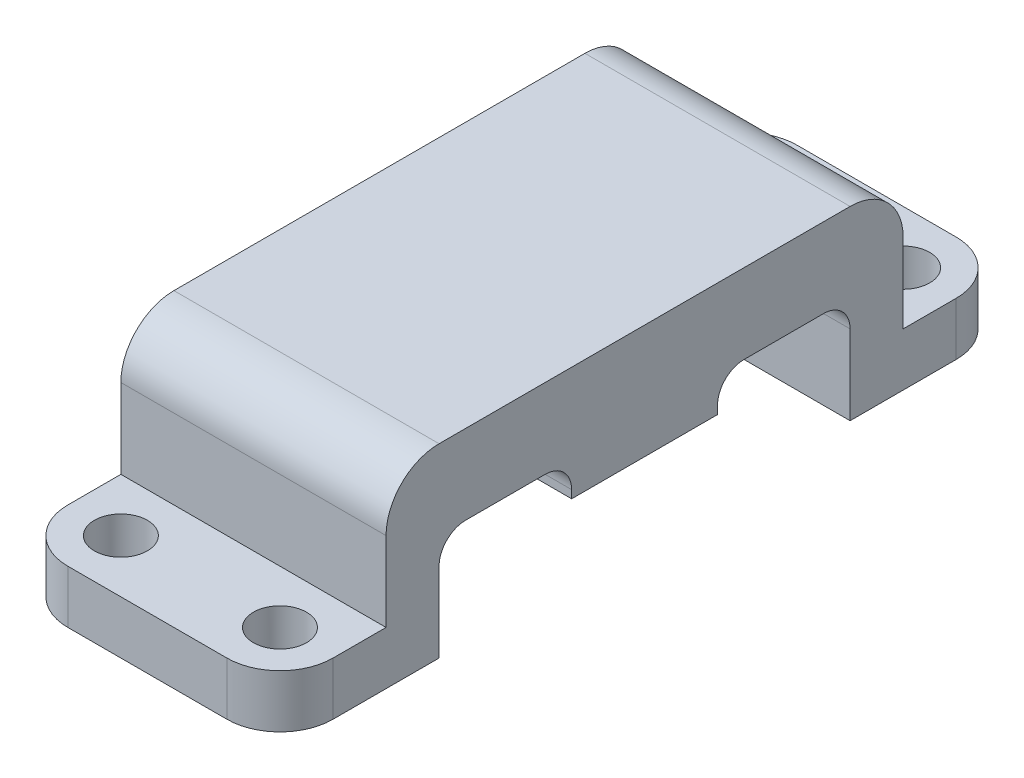
ISO-10303-21;
HEADER;
FILE_DESCRIPTION(('STEP AP214'),'2;1');
FILE_NAME('part.step','',(''),(''),'','','');
FILE_SCHEMA(('AUTOMOTIVE_DESIGN { 1 0 10303 214 1 1 1 1 }'));
ENDSEC;
DATA;
#1=APPLICATION_CONTEXT('core data for automotive mechanical design processes');
#2=APPLICATION_PROTOCOL_DEFINITION('international standard','automotive_design',2000,#1);
#3=PRODUCT_CONTEXT('',#1,'mechanical');
#4=PRODUCT('Part','Part','',(#3));
#5=PRODUCT_RELATED_PRODUCT_CATEGORY('part','',(#4));
#6=PRODUCT_DEFINITION_FORMATION('','',#4);
#7=PRODUCT_DEFINITION_CONTEXT('part definition',#1,'design');
#8=PRODUCT_DEFINITION('design','',#6,#7);
#9=PRODUCT_DEFINITION_SHAPE('','',#8);
#10=(LENGTH_UNIT() NAMED_UNIT(*) SI_UNIT(.MILLI.,.METRE.));
#11=(NAMED_UNIT(*) PLANE_ANGLE_UNIT() SI_UNIT($,.RADIAN.));
#12=(NAMED_UNIT(*) SI_UNIT($,.STERADIAN.) SOLID_ANGLE_UNIT());
#13=UNCERTAINTY_MEASURE_WITH_UNIT(LENGTH_MEASURE(1.E-05),#10,'distance_accuracy_value','');
#14=(GEOMETRIC_REPRESENTATION_CONTEXT(3) GLOBAL_UNCERTAINTY_ASSIGNED_CONTEXT((#13)) GLOBAL_UNIT_ASSIGNED_CONTEXT((#10,
#11,#12)) REPRESENTATION_CONTEXT('',''));
#15=CARTESIAN_POINT('',(0.,0.,0.));
#16=DIRECTION('',(0.,0.,1.));
#17=DIRECTION('',(1.,0.,0.));
#18=AXIS2_PLACEMENT_3D('',#15,#16,#17);
#19=CARTESIAN_POINT('',(10.,0.,2.75));
#20=DIRECTION('',(0.,0.,-1.));
#21=DIRECTION('',(-1.,0.,0.));
#22=AXIS2_PLACEMENT_3D('',#19,#20,#21);
#23=PLANE('',#22);
#24=DIRECTION('',(0.,-1.,0.));
#25=VECTOR('',#24,1.);
#26=CARTESIAN_POINT('',(10.,0.,2.75));
#27=LINE('',#26,#25);
#28=CARTESIAN_POINT('',(10.,-1.,2.75));
#29=VERTEX_POINT('',#28);
#30=CARTESIAN_POINT('',(10.,-1.3,2.75));
#31=VERTEX_POINT('',#30);
#32=EDGE_CURVE('E207',#29,#31,#27,.T.);
#33=ORIENTED_EDGE('',*,*,#32,.F.);
#34=DIRECTION('',(-1.,0.,0.));
#35=VECTOR('',#34,1.);
#36=CARTESIAN_POINT('',(0.,-1.,2.75));
#37=LINE('',#36,#35);
#38=CARTESIAN_POINT('',(0.,-1.,2.75));
#39=VERTEX_POINT('',#38);
#40=EDGE_CURVE('E311',#29,#39,#37,.T.);
#41=ORIENTED_EDGE('',*,*,#40,.T.);
#42=DIRECTION('',(0.,-1.,0.));
#43=VECTOR('',#42,1.);
#44=CARTESIAN_POINT('',(0.,0.,2.75));
#45=LINE('',#44,#43);
#46=CARTESIAN_POINT('',(0.,-1.3,2.75));
#47=VERTEX_POINT('',#46);
#48=EDGE_CURVE('E233',#39,#47,#45,.T.);
#49=ORIENTED_EDGE('',*,*,#48,.T.);
#50=DIRECTION('',(-1.,0.,0.));
#51=VECTOR('',#50,1.);
#52=CARTESIAN_POINT('',(10.,-1.3,2.75));
#53=LINE('',#52,#51);
#54=EDGE_CURVE('E226',#31,#47,#53,.T.);
#55=ORIENTED_EDGE('',*,*,#54,.F.);
#56=EDGE_LOOP('',(#33,#41,#49,#55));
#57=FACE_BOUND('',#56,.T.);
#58=ADVANCED_FACE('F35',(#57),#23,.F.);
#59=CARTESIAN_POINT('',(10.,-1.3,2.75));
#60=DIRECTION('',(0.,1.,0.));
#61=DIRECTION('',(0.,0.,1.));
#62=AXIS2_PLACEMENT_3D('',#59,#60,#61);
#63=PLANE('',#62);
#64=DIRECTION('',(0.,0.,-1.));
#65=VECTOR('',#64,1.);
#66=CARTESIAN_POINT('',(0.,-1.3,2.75));
#67=LINE('',#66,#65);
#68=CARTESIAN_POINT('',(0.,-1.3,-2.75));
#69=VERTEX_POINT('',#68);
#70=EDGE_CURVE('E435',#47,#69,#67,.T.);
#71=ORIENTED_EDGE('',*,*,#70,.T.);
#72=DIRECTION('',(-1.,0.,0.));
#73=VECTOR('',#72,1.);
#74=CARTESIAN_POINT('',(10.,-1.3,-2.75));
#75=LINE('',#74,#73);
#76=CARTESIAN_POINT('',(10.,-1.3,-2.75));
#77=VERTEX_POINT('',#76);
#78=EDGE_CURVE('E228',#77,#69,#75,.T.);
#79=ORIENTED_EDGE('',*,*,#78,.F.);
#80=DIRECTION('',(0.,0.,-1.));
#81=VECTOR('',#80,1.);
#82=CARTESIAN_POINT('',(10.,-1.3,2.75));
#83=LINE('',#82,#81);
#84=EDGE_CURVE('E212',#31,#77,#83,.T.);
#85=ORIENTED_EDGE('',*,*,#84,.F.);
#86=ORIENTED_EDGE('',*,*,#54,.T.);
#87=EDGE_LOOP('',(#71,#79,#85,#86));
#88=FACE_BOUND('',#87,.T.);
#89=ADVANCED_FACE('F225',(#88),#63,.F.);
#90=CARTESIAN_POINT('',(10.,0.,-2.75));
#91=DIRECTION('',(0.,0.,1.));
#92=DIRECTION('',(1.,0.,0.));
#93=AXIS2_PLACEMENT_3D('',#90,#91,#92);
#94=PLANE('',#93);
#95=DIRECTION('',(0.,1.,0.));
#96=VECTOR('',#95,1.);
#97=CARTESIAN_POINT('',(0.,0.,-2.75));
#98=LINE('',#97,#96);
#99=CARTESIAN_POINT('',(0.,-1.,-2.75));
#100=VERTEX_POINT('',#99);
#101=EDGE_CURVE('E437',#69,#100,#98,.T.);
#102=ORIENTED_EDGE('',*,*,#101,.T.);
#103=DIRECTION('',(-1.,0.,0.));
#104=VECTOR('',#103,1.);
#105=CARTESIAN_POINT('',(10.,-1.,-2.75));
#106=LINE('',#105,#104);
#107=CARTESIAN_POINT('',(10.,-1.,-2.75));
#108=VERTEX_POINT('',#107);
#109=EDGE_CURVE('E309',#100,#108,#106,.F.);
#110=ORIENTED_EDGE('',*,*,#109,.T.);
#111=DIRECTION('',(0.,1.,0.));
#112=VECTOR('',#111,1.);
#113=CARTESIAN_POINT('',(10.,0.,-2.75));
#114=LINE('',#113,#112);
#115=EDGE_CURVE('E230',#77,#108,#114,.T.);
#116=ORIENTED_EDGE('',*,*,#115,.F.);
#117=ORIENTED_EDGE('',*,*,#78,.T.);
#118=EDGE_LOOP('',(#102,#110,#116,#117));
#119=FACE_BOUND('',#118,.T.);
#120=ADVANCED_FACE('F356',(#119),#94,.F.);
#121=CARTESIAN_POINT('',(10.,0.,-2.75));
#122=DIRECTION('',(0.,1.,0.));
#123=DIRECTION('',(0.,0.,1.));
#124=AXIS2_PLACEMENT_3D('',#121,#122,#123);
#125=PLANE('',#124);
#126=DIRECTION('',(0.,0.,-1.));
#127=VECTOR('',#126,1.);
#128=CARTESIAN_POINT('',(0.,0.,-2.75));
#129=LINE('',#128,#127);
#130=CARTESIAN_POINT('',(0.,0.,-3.75));
#131=VERTEX_POINT('',#130);
#132=CARTESIAN_POINT('',(0.,0.,-6.75));
#133=VERTEX_POINT('',#132);
#134=EDGE_CURVE('E440',#131,#133,#129,.T.);
#135=ORIENTED_EDGE('',*,*,#134,.T.);
#136=DIRECTION('',(-1.,0.,0.));
#137=VECTOR('',#136,1.);
#138=CARTESIAN_POINT('',(10.,0.,-6.75));
#139=LINE('',#138,#137);
#140=CARTESIAN_POINT('',(10.,0.,-6.75));
#141=VERTEX_POINT('',#140);
#142=EDGE_CURVE('E307',#133,#141,#139,.F.);
#143=ORIENTED_EDGE('',*,*,#142,.T.);
#144=DIRECTION('',(0.,0.,-1.));
#145=VECTOR('',#144,1.);
#146=CARTESIAN_POINT('',(10.,0.,-2.75));
#147=LINE('',#146,#145);
#148=CARTESIAN_POINT('',(10.,0.,-3.75));
#149=VERTEX_POINT('',#148);
#150=EDGE_CURVE('E403',#149,#141,#147,.T.);
#151=ORIENTED_EDGE('',*,*,#150,.F.);
#152=DIRECTION('',(-1.,0.,0.));
#153=VECTOR('',#152,1.);
#154=CARTESIAN_POINT('',(0.,0.,-3.75));
#155=LINE('',#154,#153);
#156=EDGE_CURVE('E304',#149,#131,#155,.T.);
#157=ORIENTED_EDGE('',*,*,#156,.T.);
#158=EDGE_LOOP('',(#135,#143,#151,#157));
#159=FACE_BOUND('',#158,.T.);
#160=ADVANCED_FACE('F572',(#159),#125,.F.);
#161=CARTESIAN_POINT('',(10.,0.,-7.75));
#162=DIRECTION('',(0.,0.,-1.));
#163=DIRECTION('',(0.,1.,0.));
#164=AXIS2_PLACEMENT_3D('',#161,#162,#163);
#165=PLANE('',#164);
#166=DIRECTION('',(0.,-1.,0.));
#167=VECTOR('',#166,1.);
#168=CARTESIAN_POINT('',(10.,0.,-7.75));
#169=LINE('',#168,#167);
#170=CARTESIAN_POINT('',(10.,-1.,-7.75));
#171=VERTEX_POINT('',#170);
#172=CARTESIAN_POINT('',(10.,-4.,-7.75));
#173=VERTEX_POINT('',#172);
#174=EDGE_CURVE('E400',#171,#173,#169,.T.);
#175=ORIENTED_EDGE('',*,*,#174,.F.);
#176=DIRECTION('',(-1.,0.,0.));
#177=VECTOR('',#176,1.);
#178=CARTESIAN_POINT('',(0.,-1.,-7.75));
#179=LINE('',#178,#177);
#180=CARTESIAN_POINT('',(0.,-1.,-7.75));
#181=VERTEX_POINT('',#180);
#182=EDGE_CURVE('E294',#171,#181,#179,.T.);
#183=ORIENTED_EDGE('',*,*,#182,.T.);
#184=DIRECTION('',(0.,-1.,0.));
#185=VECTOR('',#184,1.);
#186=CARTESIAN_POINT('',(0.,0.,-7.75));
#187=LINE('',#186,#185);
#188=CARTESIAN_POINT('',(0.,-4.,-7.75));
#189=VERTEX_POINT('',#188);
#190=EDGE_CURVE('E443',#181,#189,#187,.T.);
#191=ORIENTED_EDGE('',*,*,#190,.T.);
#192=DIRECTION('',(-1.,0.,0.));
#193=VECTOR('',#192,1.);
#194=CARTESIAN_POINT('',(10.,-4.,-7.75));
#195=LINE('',#194,#193);
#196=EDGE_CURVE('E239',#173,#189,#195,.T.);
#197=ORIENTED_EDGE('',*,*,#196,.F.);
#198=EDGE_LOOP('',(#175,#183,#191,#197));
#199=FACE_BOUND('',#198,.T.);
#200=ADVANCED_FACE('F405',(#199),#165,.F.);
#201=CARTESIAN_POINT('',(10.,-4.,-7.75));
#202=DIRECTION('',(0.,1.,0.));
#203=DIRECTION('',(0.,0.,1.));
#204=AXIS2_PLACEMENT_3D('',#201,#202,#203);
#205=PLANE('',#204);
#206=CARTESIAN_POINT('',(8.,-4.,-11.75));
#207=DIRECTION('',(0.,1.,0.));
#208=DIRECTION('',(0.,0.,-1.));
#209=AXIS2_PLACEMENT_3D('',#206,#207,#208);
#210=CIRCLE('',#209,1.);
#211=CARTESIAN_POINT('',(8.,-4.,-12.75));
#212=VERTEX_POINT('',#211);
#213=EDGE_CURVE('E594',#212,#212,#210,.T.);
#214=ORIENTED_EDGE('',*,*,#213,.T.);
#215=EDGE_LOOP('',(#214));
#216=FACE_BOUND('',#215,.T.);
#217=CARTESIAN_POINT('',(2.,-4.,-11.75));
#218=DIRECTION('',(0.,1.,0.));
#219=DIRECTION('',(0.,0.,-1.));
#220=AXIS2_PLACEMENT_3D('',#217,#218,#219);
#221=CIRCLE('',#220,1.);
#222=CARTESIAN_POINT('',(2.,-4.,-12.75));
#223=VERTEX_POINT('',#222);
#224=EDGE_CURVE('E597',#223,#223,#221,.T.);
#225=ORIENTED_EDGE('',*,*,#224,.T.);
#226=EDGE_LOOP('',(#225));
#227=FACE_BOUND('',#226,.T.);
#228=DIRECTION('',(0.,0.,-1.));
#229=VECTOR('',#228,1.);
#230=CARTESIAN_POINT('',(0.,-4.,-7.75));
#231=LINE('',#230,#229);
#232=CARTESIAN_POINT('',(0.,-4.,-11.75));
#233=VERTEX_POINT('',#232);
#234=EDGE_CURVE('E445',#189,#233,#231,.T.);
#235=ORIENTED_EDGE('',*,*,#234,.T.);
#236=CARTESIAN_POINT('',(2.,-4.,-11.75));
#237=DIRECTION('',(0.,1.,0.));
#238=DIRECTION('',(0.,0.,1.));
#239=AXIS2_PLACEMENT_3D('',#236,#237,#238);
#240=CIRCLE('',#239,2.);
#241=CARTESIAN_POINT('',(2.,-4.,-13.75));
#242=VERTEX_POINT('',#241);
#243=EDGE_CURVE('E279',#233,#242,#240,.F.);
#244=ORIENTED_EDGE('',*,*,#243,.T.);
#245=DIRECTION('',(-1.,0.,0.));
#246=VECTOR('',#245,1.);
#247=CARTESIAN_POINT('',(10.,-4.,-13.75));
#248=LINE('',#247,#246);
#249=CARTESIAN_POINT('',(8.,-4.,-13.75));
#250=VERTEX_POINT('',#249);
#251=EDGE_CURVE('E481',#250,#242,#248,.T.);
#252=ORIENTED_EDGE('',*,*,#251,.F.);
#253=CARTESIAN_POINT('',(8.,-4.,-11.75));
#254=DIRECTION('',(0.,1.,0.));
#255=DIRECTION('',(0.,0.,1.));
#256=AXIS2_PLACEMENT_3D('',#253,#254,#255);
#257=CIRCLE('',#256,2.);
#258=CARTESIAN_POINT('',(10.,-4.,-11.75));
#259=VERTEX_POINT('',#258);
#260=EDGE_CURVE('E277',#250,#259,#257,.F.);
#261=ORIENTED_EDGE('',*,*,#260,.T.);
#262=DIRECTION('',(0.,0.,-1.));
#263=VECTOR('',#262,1.);
#264=CARTESIAN_POINT('',(10.,-4.,-7.75));
#265=LINE('',#264,#263);
#266=EDGE_CURVE('E409',#173,#259,#265,.T.);
#267=ORIENTED_EDGE('',*,*,#266,.F.);
#268=ORIENTED_EDGE('',*,*,#196,.T.);
#269=EDGE_LOOP('',(#235,#244,#252,#261,#267,#268));
#270=FACE_BOUND('',#269,.T.);
#271=ADVANCED_FACE('F485',(#216,#227,#270),#205,.F.);
#272=CARTESIAN_POINT('',(10.,-4.,-13.75));
#273=DIRECTION('',(0.,0.,1.));
#274=DIRECTION('',(1.,0.,0.));
#275=AXIS2_PLACEMENT_3D('',#272,#273,#274);
#276=PLANE('',#275);
#277=ORIENTED_EDGE('',*,*,#251,.T.);
#278=DIRECTION('',(0.,1.,0.));
#279=VECTOR('',#278,1.);
#280=CARTESIAN_POINT('',(2.,-4.,-13.75));
#281=LINE('',#280,#279);
#282=CARTESIAN_POINT('',(2.,-2.,-13.75));
#283=VERTEX_POINT('',#282);
#284=EDGE_CURVE('E270',#242,#283,#281,.T.);
#285=ORIENTED_EDGE('',*,*,#284,.T.);
#286=DIRECTION('',(-1.,0.,0.));
#287=VECTOR('',#286,1.);
#288=CARTESIAN_POINT('',(10.,-2.,-13.75));
#289=LINE('',#288,#287);
#290=CARTESIAN_POINT('',(8.,-2.,-13.75));
#291=VERTEX_POINT('',#290);
#292=EDGE_CURVE('E478',#291,#283,#289,.T.);
#293=ORIENTED_EDGE('',*,*,#292,.F.);
#294=DIRECTION('',(0.,1.,0.));
#295=VECTOR('',#294,1.);
#296=CARTESIAN_POINT('',(8.,-4.,-13.75));
#297=LINE('',#296,#295);
#298=EDGE_CURVE('E268',#291,#250,#297,.F.);
#299=ORIENTED_EDGE('',*,*,#298,.T.);
#300=EDGE_LOOP('',(#277,#285,#293,#299));
#301=FACE_BOUND('',#300,.T.);
#302=ADVANCED_FACE('F494',(#301),#276,.F.);
#303=CARTESIAN_POINT('',(10.,-2.,-13.75));
#304=DIRECTION('',(0.,-1.,0.));
#305=DIRECTION('',(0.,0.,-1.));
#306=AXIS2_PLACEMENT_3D('',#303,#304,#305);
#307=PLANE('',#306);
#308=CARTESIAN_POINT('',(8.,-2.,-11.75));
#309=DIRECTION('',(0.,-1.,0.));
#310=DIRECTION('',(0.,0.,-1.));
#311=AXIS2_PLACEMENT_3D('',#308,#309,#310);
#312=CIRCLE('',#311,1.);
#313=CARTESIAN_POINT('',(8.,-2.,-12.75));
#314=VERTEX_POINT('',#313);
#315=EDGE_CURVE('E298',#314,#314,#312,.T.);
#316=ORIENTED_EDGE('',*,*,#315,.T.);
#317=EDGE_LOOP('',(#316));
#318=FACE_BOUND('',#317,.T.);
#319=CARTESIAN_POINT('',(2.,-2.,-11.75));
#320=DIRECTION('',(0.,-1.,0.));
#321=DIRECTION('',(0.,0.,-1.));
#322=AXIS2_PLACEMENT_3D('',#319,#320,#321);
#323=CIRCLE('',#322,1.);
#324=CARTESIAN_POINT('',(2.,-2.,-12.75));
#325=VERTEX_POINT('',#324);
#326=EDGE_CURVE('E295',#325,#325,#323,.T.);
#327=ORIENTED_EDGE('',*,*,#326,.T.);
#328=EDGE_LOOP('',(#327));
#329=FACE_BOUND('',#328,.T.);
#330=ORIENTED_EDGE('',*,*,#292,.T.);
#331=CARTESIAN_POINT('',(2.,-2.,-11.75));
#332=DIRECTION('',(0.,-1.,0.));
#333=DIRECTION('',(0.,0.,-1.));
#334=AXIS2_PLACEMENT_3D('',#331,#332,#333);
#335=CIRCLE('',#334,2.);
#336=CARTESIAN_POINT('',(0.,-2.,-11.75));
#337=VERTEX_POINT('',#336);
#338=EDGE_CURVE('E275',#283,#337,#335,.F.);
#339=ORIENTED_EDGE('',*,*,#338,.T.);
#340=DIRECTION('',(0.,0.,1.));
#341=VECTOR('',#340,1.);
#342=CARTESIAN_POINT('',(0.,-2.,-13.75));
#343=LINE('',#342,#341);
#344=CARTESIAN_POINT('',(0.,-2.,-9.75));
#345=VERTEX_POINT('',#344);
#346=EDGE_CURVE('E448',#337,#345,#343,.T.);
#347=ORIENTED_EDGE('',*,*,#346,.T.);
#348=DIRECTION('',(-1.,0.,0.));
#349=VECTOR('',#348,1.);
#350=CARTESIAN_POINT('',(10.,-2.,-9.75));
#351=LINE('',#350,#349);
#352=CARTESIAN_POINT('',(10.,-2.,-9.75));
#353=VERTEX_POINT('',#352);
#354=EDGE_CURVE('E475',#353,#345,#351,.T.);
#355=ORIENTED_EDGE('',*,*,#354,.F.);
#356=DIRECTION('',(0.,0.,1.));
#357=VECTOR('',#356,1.);
#358=CARTESIAN_POINT('',(10.,-2.,-13.75));
#359=LINE('',#358,#357);
#360=CARTESIAN_POINT('',(10.,-2.,-11.75));
#361=VERTEX_POINT('',#360);
#362=EDGE_CURVE('E411',#361,#353,#359,.T.);
#363=ORIENTED_EDGE('',*,*,#362,.F.);
#364=CARTESIAN_POINT('',(8.,-2.,-11.75));
#365=DIRECTION('',(0.,-1.,0.));
#366=DIRECTION('',(0.,0.,-1.));
#367=AXIS2_PLACEMENT_3D('',#364,#365,#366);
#368=CIRCLE('',#367,2.);
#369=EDGE_CURVE('E273',#361,#291,#368,.F.);
#370=ORIENTED_EDGE('',*,*,#369,.T.);
#371=EDGE_LOOP('',(#330,#339,#347,#355,#363,#370));
#372=FACE_BOUND('',#371,.T.);
#373=ADVANCED_FACE('F501',(#318,#329,#372),#307,.F.);
#374=CARTESIAN_POINT('',(10.,-2.,-9.75));
#375=DIRECTION('',(0.,0.,1.));
#376=DIRECTION('',(0.,-1.,0.));
#377=AXIS2_PLACEMENT_3D('',#374,#375,#376);
#378=PLANE('',#377);
#379=DIRECTION('',(0.,1.,0.));
#380=VECTOR('',#379,1.);
#381=CARTESIAN_POINT('',(0.,-2.,-9.75));
#382=LINE('',#381,#380);
#383=CARTESIAN_POINT('',(0.,0.999999999999999,-9.75));
#384=VERTEX_POINT('',#383);
#385=EDGE_CURVE('E450',#345,#384,#382,.T.);
#386=ORIENTED_EDGE('',*,*,#385,.T.);
#387=DIRECTION('',(-1.,0.,0.));
#388=VECTOR('',#387,1.);
#389=CARTESIAN_POINT('',(10.,1.,-9.75));
#390=LINE('',#389,#388);
#391=CARTESIAN_POINT('',(10.,0.999999999999999,-9.75));
#392=VERTEX_POINT('',#391);
#393=EDGE_CURVE('E253',#384,#392,#390,.F.);
#394=ORIENTED_EDGE('',*,*,#393,.T.);
#395=DIRECTION('',(0.,1.,0.));
#396=VECTOR('',#395,1.);
#397=CARTESIAN_POINT('',(10.,-2.,-9.75));
#398=LINE('',#397,#396);
#399=EDGE_CURVE('E417',#353,#392,#398,.T.);
#400=ORIENTED_EDGE('',*,*,#399,.F.);
#401=ORIENTED_EDGE('',*,*,#354,.T.);
#402=EDGE_LOOP('',(#386,#394,#400,#401));
#403=FACE_BOUND('',#402,.T.);
#404=ADVANCED_FACE('F504',(#403),#378,.F.);
#405=CARTESIAN_POINT('',(10.,3.,9.75));
#406=DIRECTION('',(0.,-1.,0.));
#407=DIRECTION('',(0.,0.,-1.));
#408=AXIS2_PLACEMENT_3D('',#405,#406,#407);
#409=PLANE('',#408);
#410=DIRECTION('',(0.,0.,1.));
#411=VECTOR('',#410,1.);
#412=CARTESIAN_POINT('',(10.,3.,9.75));
#413=LINE('',#412,#411);
#414=CARTESIAN_POINT('',(10.,3.,-7.75));
#415=VERTEX_POINT('',#414);
#416=CARTESIAN_POINT('',(10.,3.,7.75));
#417=VERTEX_POINT('',#416);
#418=EDGE_CURVE('E419',#415,#417,#413,.T.);
#419=ORIENTED_EDGE('',*,*,#418,.F.);
#420=DIRECTION('',(-1.,0.,0.));
#421=VECTOR('',#420,1.);
#422=CARTESIAN_POINT('',(10.,3.,-7.75));
#423=LINE('',#422,#421);
#424=CARTESIAN_POINT('',(0.,3.,-7.75));
#425=VERTEX_POINT('',#424);
#426=EDGE_CURVE('E237',#415,#425,#423,.T.);
#427=ORIENTED_EDGE('',*,*,#426,.T.);
#428=DIRECTION('',(0.,0.,1.));
#429=VECTOR('',#428,1.);
#430=CARTESIAN_POINT('',(0.,3.,9.75));
#431=LINE('',#430,#429);
#432=CARTESIAN_POINT('',(0.,3.,7.75));
#433=VERTEX_POINT('',#432);
#434=EDGE_CURVE('E453',#425,#433,#431,.T.);
#435=ORIENTED_EDGE('',*,*,#434,.T.);
#436=DIRECTION('',(-1.,0.,0.));
#437=VECTOR('',#436,1.);
#438=CARTESIAN_POINT('',(10.,3.,7.75));
#439=LINE('',#438,#437);
#440=EDGE_CURVE('E235',#433,#417,#439,.F.);
#441=ORIENTED_EDGE('',*,*,#440,.T.);
#442=EDGE_LOOP('',(#419,#427,#435,#441));
#443=FACE_BOUND('',#442,.T.);
#444=ADVANCED_FACE('F510',(#443),#409,.F.);
#445=CARTESIAN_POINT('',(10.,-2.,9.75));
#446=DIRECTION('',(0.,0.,-1.));
#447=DIRECTION('',(0.,1.,0.));
#448=AXIS2_PLACEMENT_3D('',#445,#446,#447);
#449=PLANE('',#448);
#450=DIRECTION('',(0.,-1.,0.));
#451=VECTOR('',#450,1.);
#452=CARTESIAN_POINT('',(10.,-2.,9.75));
#453=LINE('',#452,#451);
#454=CARTESIAN_POINT('',(10.,0.999999999999999,9.75));
#455=VERTEX_POINT('',#454);
#456=CARTESIAN_POINT('',(10.,-2.,9.75));
#457=VERTEX_POINT('',#456);
#458=EDGE_CURVE('E422',#455,#457,#453,.T.);
#459=ORIENTED_EDGE('',*,*,#458,.F.);
#460=DIRECTION('',(-1.,0.,0.));
#461=VECTOR('',#460,1.);
#462=CARTESIAN_POINT('',(10.,1.,9.75));
#463=LINE('',#462,#461);
#464=CARTESIAN_POINT('',(0.,0.999999999999999,9.75));
#465=VERTEX_POINT('',#464);
#466=EDGE_CURVE('E265',#455,#465,#463,.T.);
#467=ORIENTED_EDGE('',*,*,#466,.T.);
#468=DIRECTION('',(0.,-1.,0.));
#469=VECTOR('',#468,1.);
#470=CARTESIAN_POINT('',(0.,-2.,9.75));
#471=LINE('',#470,#469);
#472=CARTESIAN_POINT('',(0.,-2.,9.75));
#473=VERTEX_POINT('',#472);
#474=EDGE_CURVE('E456',#465,#473,#471,.T.);
#475=ORIENTED_EDGE('',*,*,#474,.T.);
#476=DIRECTION('',(-1.,0.,0.));
#477=VECTOR('',#476,1.);
#478=CARTESIAN_POINT('',(10.,-2.,9.75));
#479=LINE('',#478,#477);
#480=EDGE_CURVE('E472',#457,#473,#479,.T.);
#481=ORIENTED_EDGE('',*,*,#480,.F.);
#482=EDGE_LOOP('',(#459,#467,#475,#481));
#483=FACE_BOUND('',#482,.T.);
#484=ADVANCED_FACE('F518',(#483),#449,.F.);
#485=CARTESIAN_POINT('',(10.,-2.,13.75));
#486=DIRECTION('',(0.,-1.,0.));
#487=DIRECTION('',(0.,0.,-1.));
#488=AXIS2_PLACEMENT_3D('',#485,#486,#487);
#489=PLANE('',#488);
#490=CARTESIAN_POINT('',(2.,-2.,11.75));
#491=DIRECTION('',(0.,-1.,0.));
#492=DIRECTION('',(0.,0.,-1.));
#493=AXIS2_PLACEMENT_3D('',#490,#491,#492);
#494=CIRCLE('',#493,1.);
#495=CARTESIAN_POINT('',(2.,-2.,10.75));
#496=VERTEX_POINT('',#495);
#497=EDGE_CURVE('E299',#496,#496,#494,.T.);
#498=ORIENTED_EDGE('',*,*,#497,.T.);
#499=EDGE_LOOP('',(#498));
#500=FACE_BOUND('',#499,.T.);
#501=CARTESIAN_POINT('',(8.,-2.,11.75));
#502=DIRECTION('',(0.,-1.,0.));
#503=DIRECTION('',(0.,0.,-1.));
#504=AXIS2_PLACEMENT_3D('',#501,#502,#503);
#505=CIRCLE('',#504,1.);
#506=CARTESIAN_POINT('',(8.,-2.,10.75));
#507=VERTEX_POINT('',#506);
#508=EDGE_CURVE('E587',#507,#507,#505,.T.);
#509=ORIENTED_EDGE('',*,*,#508,.T.);
#510=EDGE_LOOP('',(#509));
#511=FACE_BOUND('',#510,.T.);
#512=DIRECTION('',(0.,0.,1.));
#513=VECTOR('',#512,1.);
#514=CARTESIAN_POINT('',(0.,-2.,13.75));
#515=LINE('',#514,#513);
#516=CARTESIAN_POINT('',(0.,-2.,11.75));
#517=VERTEX_POINT('',#516);
#518=EDGE_CURVE('E458',#473,#517,#515,.T.);
#519=ORIENTED_EDGE('',*,*,#518,.T.);
#520=CARTESIAN_POINT('',(2.,-2.,11.75));
#521=DIRECTION('',(0.,-1.,0.));
#522=DIRECTION('',(0.,0.,-1.));
#523=AXIS2_PLACEMENT_3D('',#520,#521,#522);
#524=CIRCLE('',#523,2.);
#525=CARTESIAN_POINT('',(2.,-2.,13.75));
#526=VERTEX_POINT('',#525);
#527=EDGE_CURVE('E292',#517,#526,#524,.F.);
#528=ORIENTED_EDGE('',*,*,#527,.T.);
#529=DIRECTION('',(-1.,0.,0.));
#530=VECTOR('',#529,1.);
#531=CARTESIAN_POINT('',(10.,-2.,13.75));
#532=LINE('',#531,#530);
#533=CARTESIAN_POINT('',(8.,-2.,13.75));
#534=VERTEX_POINT('',#533);
#535=EDGE_CURVE('E469',#534,#526,#532,.T.);
#536=ORIENTED_EDGE('',*,*,#535,.F.);
#537=CARTESIAN_POINT('',(8.,-2.,11.75));
#538=DIRECTION('',(0.,-1.,0.));
#539=DIRECTION('',(0.,0.,-1.));
#540=AXIS2_PLACEMENT_3D('',#537,#538,#539);
#541=CIRCLE('',#540,2.);
#542=CARTESIAN_POINT('',(10.,-2.,11.75));
#543=VERTEX_POINT('',#542);
#544=EDGE_CURVE('E290',#534,#543,#541,.F.);
#545=ORIENTED_EDGE('',*,*,#544,.T.);
#546=DIRECTION('',(0.,0.,1.));
#547=VECTOR('',#546,1.);
#548=CARTESIAN_POINT('',(10.,-2.,13.75));
#549=LINE('',#548,#547);
#550=EDGE_CURVE('E424',#457,#543,#549,.T.);
#551=ORIENTED_EDGE('',*,*,#550,.F.);
#552=ORIENTED_EDGE('',*,*,#480,.T.);
#553=EDGE_LOOP('',(#519,#528,#536,#545,#551,#552));
#554=FACE_BOUND('',#553,.T.);
#555=ADVANCED_FACE('F552',(#500,#511,#554),#489,.F.);
#556=CARTESIAN_POINT('',(10.,-4.,13.75));
#557=DIRECTION('',(0.,0.,-1.));
#558=DIRECTION('',(-1.,0.,0.));
#559=AXIS2_PLACEMENT_3D('',#556,#557,#558);
#560=PLANE('',#559);
#561=ORIENTED_EDGE('',*,*,#535,.T.);
#562=DIRECTION('',(0.,-1.,0.));
#563=VECTOR('',#562,1.);
#564=CARTESIAN_POINT('',(2.,-4.,13.75));
#565=LINE('',#564,#563);
#566=CARTESIAN_POINT('',(2.,-4.,13.75));
#567=VERTEX_POINT('',#566);
#568=EDGE_CURVE('E283',#526,#567,#565,.T.);
#569=ORIENTED_EDGE('',*,*,#568,.T.);
#570=DIRECTION('',(-1.,0.,0.));
#571=VECTOR('',#570,1.);
#572=CARTESIAN_POINT('',(10.,-4.,13.75));
#573=LINE('',#572,#571);
#574=CARTESIAN_POINT('',(8.,-4.,13.75));
#575=VERTEX_POINT('',#574);
#576=EDGE_CURVE('E466',#575,#567,#573,.T.);
#577=ORIENTED_EDGE('',*,*,#576,.F.);
#578=DIRECTION('',(0.,-1.,0.));
#579=VECTOR('',#578,1.);
#580=CARTESIAN_POINT('',(8.,-2.,13.75));
#581=LINE('',#580,#579);
#582=EDGE_CURVE('E281',#575,#534,#581,.F.);
#583=ORIENTED_EDGE('',*,*,#582,.T.);
#584=EDGE_LOOP('',(#561,#569,#577,#583));
#585=FACE_BOUND('',#584,.T.);
#586=ADVANCED_FACE('F531',(#585),#560,.F.);
#587=CARTESIAN_POINT('',(10.,-4.,7.75));
#588=DIRECTION('',(0.,1.,0.));
#589=DIRECTION('',(0.,0.,1.));
#590=AXIS2_PLACEMENT_3D('',#587,#588,#589);
#591=PLANE('',#590);
#592=CARTESIAN_POINT('',(2.,-4.,11.75));
#593=DIRECTION('',(0.,1.,0.));
#594=DIRECTION('',(0.,0.,1.));
#595=AXIS2_PLACEMENT_3D('',#592,#593,#594);
#596=CIRCLE('',#595,1.);
#597=CARTESIAN_POINT('',(2.,-4.,12.75));
#598=VERTEX_POINT('',#597);
#599=EDGE_CURVE('E593',#598,#598,#596,.T.);
#600=ORIENTED_EDGE('',*,*,#599,.T.);
#601=EDGE_LOOP('',(#600));
#602=FACE_BOUND('',#601,.T.);
#603=CARTESIAN_POINT('',(8.,-4.,11.75));
#604=DIRECTION('',(0.,1.,0.));
#605=DIRECTION('',(0.,0.,1.));
#606=AXIS2_PLACEMENT_3D('',#603,#604,#605);
#607=CIRCLE('',#606,1.);
#608=CARTESIAN_POINT('',(8.,-4.,12.75));
#609=VERTEX_POINT('',#608);
#610=EDGE_CURVE('E590',#609,#609,#607,.T.);
#611=ORIENTED_EDGE('',*,*,#610,.T.);
#612=EDGE_LOOP('',(#611));
#613=FACE_BOUND('',#612,.T.);
#614=ORIENTED_EDGE('',*,*,#576,.T.);
#615=CARTESIAN_POINT('',(2.,-4.,11.75));
#616=DIRECTION('',(0.,1.,0.));
#617=DIRECTION('',(0.,0.,1.));
#618=AXIS2_PLACEMENT_3D('',#615,#616,#617);
#619=CIRCLE('',#618,2.);
#620=CARTESIAN_POINT('',(0.,-4.,11.75));
#621=VERTEX_POINT('',#620);
#622=EDGE_CURVE('E288',#567,#621,#619,.F.);
#623=ORIENTED_EDGE('',*,*,#622,.T.);
#624=DIRECTION('',(0.,0.,-1.));
#625=VECTOR('',#624,1.);
#626=CARTESIAN_POINT('',(0.,-4.,7.75));
#627=LINE('',#626,#625);
#628=CARTESIAN_POINT('',(0.,-4.,7.75));
#629=VERTEX_POINT('',#628);
#630=EDGE_CURVE('E461',#621,#629,#627,.T.);
#631=ORIENTED_EDGE('',*,*,#630,.T.);
#632=DIRECTION('',(-1.,0.,0.));
#633=VECTOR('',#632,1.);
#634=CARTESIAN_POINT('',(10.,-4.,7.75));
#635=LINE('',#634,#633);
#636=CARTESIAN_POINT('',(10.,-4.,7.75));
#637=VERTEX_POINT('',#636);
#638=EDGE_CURVE('E433',#637,#629,#635,.T.);
#639=ORIENTED_EDGE('',*,*,#638,.F.);
#640=DIRECTION('',(0.,0.,-1.));
#641=VECTOR('',#640,1.);
#642=CARTESIAN_POINT('',(10.,-4.,7.75));
#643=LINE('',#642,#641);
#644=CARTESIAN_POINT('',(10.,-4.,11.75));
#645=VERTEX_POINT('',#644);
#646=EDGE_CURVE('E427',#645,#637,#643,.T.);
#647=ORIENTED_EDGE('',*,*,#646,.F.);
#648=CARTESIAN_POINT('',(8.,-4.,11.75));
#649=DIRECTION('',(0.,1.,0.));
#650=DIRECTION('',(0.,0.,1.));
#651=AXIS2_PLACEMENT_3D('',#648,#649,#650);
#652=CIRCLE('',#651,2.);
#653=EDGE_CURVE('E286',#645,#575,#652,.F.);
#654=ORIENTED_EDGE('',*,*,#653,.T.);
#655=EDGE_LOOP('',(#614,#623,#631,#639,#647,#654));
#656=FACE_BOUND('',#655,.T.);
#657=ADVANCED_FACE('F528',(#602,#613,#656),#591,.F.);
#658=CARTESIAN_POINT('',(10.,0.,7.75));
#659=DIRECTION('',(0.,0.,1.));
#660=DIRECTION('',(0.,-1.,0.));
#661=AXIS2_PLACEMENT_3D('',#658,#659,#660);
#662=PLANE('',#661);
#663=DIRECTION('',(0.,1.,0.));
#664=VECTOR('',#663,1.);
#665=CARTESIAN_POINT('',(0.,0.,7.75));
#666=LINE('',#665,#664);
#667=CARTESIAN_POINT('',(0.,-1.,7.75));
#668=VERTEX_POINT('',#667);
#669=EDGE_CURVE('E338',#629,#668,#666,.T.);
#670=ORIENTED_EDGE('',*,*,#669,.T.);
#671=DIRECTION('',(-1.,0.,0.));
#672=VECTOR('',#671,1.);
#673=CARTESIAN_POINT('',(10.,-1.,7.75));
#674=LINE('',#673,#672);
#675=CARTESIAN_POINT('',(10.,-1.,7.75));
#676=VERTEX_POINT('',#675);
#677=EDGE_CURVE('E50',#668,#676,#674,.F.);
#678=ORIENTED_EDGE('',*,*,#677,.T.);
#679=DIRECTION('',(0.,1.,0.));
#680=VECTOR('',#679,1.);
#681=CARTESIAN_POINT('',(10.,0.,7.75));
#682=LINE('',#681,#680);
#683=EDGE_CURVE('E429',#637,#676,#682,.T.);
#684=ORIENTED_EDGE('',*,*,#683,.F.);
#685=ORIENTED_EDGE('',*,*,#638,.T.);
#686=EDGE_LOOP('',(#670,#678,#684,#685));
#687=FACE_BOUND('',#686,.T.);
#688=ADVANCED_FACE('F537',(#687),#662,.F.);
#689=CARTESIAN_POINT('',(10.,0.,2.75));
#690=DIRECTION('',(0.,1.,0.));
#691=DIRECTION('',(0.,0.,1.));
#692=AXIS2_PLACEMENT_3D('',#689,#690,#691);
#693=PLANE('',#692);
#694=DIRECTION('',(0.,0.,-1.));
#695=VECTOR('',#694,1.);
#696=CARTESIAN_POINT('',(0.,0.,2.75));
#697=LINE('',#696,#695);
#698=CARTESIAN_POINT('',(0.,0.,6.75));
#699=VERTEX_POINT('',#698);
#700=CARTESIAN_POINT('',(0.,0.,3.75));
#701=VERTEX_POINT('',#700);
#702=EDGE_CURVE('E221',#699,#701,#697,.T.);
#703=ORIENTED_EDGE('',*,*,#702,.T.);
#704=DIRECTION('',(-1.,0.,0.));
#705=VECTOR('',#704,1.);
#706=CARTESIAN_POINT('',(10.,0.,3.75));
#707=LINE('',#706,#705);
#708=CARTESIAN_POINT('',(10.,0.,3.75));
#709=VERTEX_POINT('',#708);
#710=EDGE_CURVE('E316',#701,#709,#707,.F.);
#711=ORIENTED_EDGE('',*,*,#710,.T.);
#712=DIRECTION('',(0.,0.,-1.));
#713=VECTOR('',#712,1.);
#714=CARTESIAN_POINT('',(10.,0.,2.75));
#715=LINE('',#714,#713);
#716=CARTESIAN_POINT('',(10.,0.,6.75));
#717=VERTEX_POINT('',#716);
#718=EDGE_CURVE('E431',#717,#709,#715,.T.);
#719=ORIENTED_EDGE('',*,*,#718,.F.);
#720=DIRECTION('',(-1.,0.,0.));
#721=VECTOR('',#720,1.);
#722=CARTESIAN_POINT('',(0.,0.,6.75));
#723=LINE('',#722,#721);
#724=EDGE_CURVE('E313',#717,#699,#723,.T.);
#725=ORIENTED_EDGE('',*,*,#724,.T.);
#726=EDGE_LOOP('',(#703,#711,#719,#725));
#727=FACE_BOUND('',#726,.T.);
#728=ADVANCED_FACE('F335',(#727),#693,.F.);
#729=CARTESIAN_POINT('',(10.,0.,0.));
#730=DIRECTION('',(1.,0.,0.));
#731=DIRECTION('',(0.,0.,-1.));
#732=AXIS2_PLACEMENT_3D('',#729,#730,#731);
#733=PLANE('',#732);
#734=ORIENTED_EDGE('',*,*,#399,.T.);
#735=CARTESIAN_POINT('',(10.,0.999999999999999,-7.75));
#736=DIRECTION('',(1.,0.,0.));
#737=DIRECTION('',(0.,0.,-1.));
#738=AXIS2_PLACEMENT_3D('',#735,#736,#737);
#739=CIRCLE('',#738,2.);
#740=EDGE_CURVE('E263',#392,#415,#739,.T.);
#741=ORIENTED_EDGE('',*,*,#740,.T.);
#742=ORIENTED_EDGE('',*,*,#418,.T.);
#743=CARTESIAN_POINT('',(10.,0.999999999999999,7.75));
#744=DIRECTION('',(1.,0.,0.));
#745=DIRECTION('',(0.,0.,-1.));
#746=AXIS2_PLACEMENT_3D('',#743,#744,#745);
#747=CIRCLE('',#746,2.);
#748=EDGE_CURVE('E261',#417,#455,#747,.T.);
#749=ORIENTED_EDGE('',*,*,#748,.T.);
#750=ORIENTED_EDGE('',*,*,#458,.T.);
#751=ORIENTED_EDGE('',*,*,#550,.T.);
#752=DIRECTION('',(0.,-1.,0.));
#753=VECTOR('',#752,1.);
#754=CARTESIAN_POINT('',(10.,-4.,11.75));
#755=LINE('',#754,#753);
#756=EDGE_CURVE('E255',#543,#645,#755,.T.);
#757=ORIENTED_EDGE('',*,*,#756,.T.);
#758=ORIENTED_EDGE('',*,*,#646,.T.);
#759=ORIENTED_EDGE('',*,*,#683,.T.);
#760=CARTESIAN_POINT('',(10.,-1.,6.75));
#761=DIRECTION('',(1.,0.,0.));
#762=DIRECTION('',(0.,0.,-1.));
#763=AXIS2_PLACEMENT_3D('',#760,#761,#762);
#764=CIRCLE('',#763,1.);
#765=EDGE_CURVE('E11',#676,#717,#764,.F.);
#766=ORIENTED_EDGE('',*,*,#765,.T.);
#767=ORIENTED_EDGE('',*,*,#718,.T.);
#768=CARTESIAN_POINT('',(10.,-1.,3.75));
#769=DIRECTION('',(1.,0.,0.));
#770=DIRECTION('',(0.,0.,-1.));
#771=AXIS2_PLACEMENT_3D('',#768,#769,#770);
#772=CIRCLE('',#771,1.);
#773=EDGE_CURVE('E216',#709,#29,#772,.F.);
#774=ORIENTED_EDGE('',*,*,#773,.T.);
#775=ORIENTED_EDGE('',*,*,#32,.T.);
#776=ORIENTED_EDGE('',*,*,#84,.T.);
#777=ORIENTED_EDGE('',*,*,#115,.T.);
#778=CARTESIAN_POINT('',(10.,-1.,-3.75));
#779=DIRECTION('',(1.,0.,0.));
#780=DIRECTION('',(0.,0.,-1.));
#781=AXIS2_PLACEMENT_3D('',#778,#779,#780);
#782=CIRCLE('',#781,1.);
#783=EDGE_CURVE('E325',#108,#149,#782,.F.);
#784=ORIENTED_EDGE('',*,*,#783,.T.);
#785=ORIENTED_EDGE('',*,*,#150,.T.);
#786=CARTESIAN_POINT('',(10.,-1.,-6.75));
#787=DIRECTION('',(1.,0.,0.));
#788=DIRECTION('',(0.,0.,-1.));
#789=AXIS2_PLACEMENT_3D('',#786,#787,#788);
#790=CIRCLE('',#789,1.);
#791=EDGE_CURVE('E321',#141,#171,#790,.F.);
#792=ORIENTED_EDGE('',*,*,#791,.T.);
#793=ORIENTED_EDGE('',*,*,#174,.T.);
#794=ORIENTED_EDGE('',*,*,#266,.T.);
#795=DIRECTION('',(0.,1.,0.));
#796=VECTOR('',#795,1.);
#797=CARTESIAN_POINT('',(10.,-2.,-11.75));
#798=LINE('',#797,#796);
#799=EDGE_CURVE('E258',#259,#361,#798,.T.);
#800=ORIENTED_EDGE('',*,*,#799,.T.);
#801=ORIENTED_EDGE('',*,*,#362,.T.);
#802=EDGE_LOOP('',(#734,#741,#742,#749,#750,#751,#757,#758,#759,#766,#767,#774,#775,#776,#777,
#784,#785,#792,#793,#794,#800,#801));
#803=FACE_BOUND('',#802,.T.);
#804=ADVANCED_FACE('F210',(#803),#733,.T.);
#805=CARTESIAN_POINT('',(0.,0.,0.));
#806=DIRECTION('',(1.,0.,0.));
#807=DIRECTION('',(0.,0.,-1.));
#808=AXIS2_PLACEMENT_3D('',#805,#806,#807);
#809=PLANE('',#808);
#810=ORIENTED_EDGE('',*,*,#434,.F.);
#811=CARTESIAN_POINT('',(0.,0.999999999999999,-7.75));
#812=DIRECTION('',(1.,0.,0.));
#813=DIRECTION('',(0.,0.,-1.));
#814=AXIS2_PLACEMENT_3D('',#811,#812,#813);
#815=CIRCLE('',#814,2.);
#816=EDGE_CURVE('E251',#425,#384,#815,.F.);
#817=ORIENTED_EDGE('',*,*,#816,.T.);
#818=ORIENTED_EDGE('',*,*,#385,.F.);
#819=ORIENTED_EDGE('',*,*,#346,.F.);
#820=DIRECTION('',(0.,1.,0.));
#821=VECTOR('',#820,1.);
#822=CARTESIAN_POINT('',(0.,0.,-11.75));
#823=LINE('',#822,#821);
#824=EDGE_CURVE('E247',#337,#233,#823,.F.);
#825=ORIENTED_EDGE('',*,*,#824,.T.);
#826=ORIENTED_EDGE('',*,*,#234,.F.);
#827=ORIENTED_EDGE('',*,*,#190,.F.);
#828=CARTESIAN_POINT('',(0.,-1.,-6.75));
#829=DIRECTION('',(1.,0.,0.));
#830=DIRECTION('',(0.,0.,-1.));
#831=AXIS2_PLACEMENT_3D('',#828,#829,#830);
#832=CIRCLE('',#831,1.);
#833=EDGE_CURVE('E319',#181,#133,#832,.T.);
#834=ORIENTED_EDGE('',*,*,#833,.T.);
#835=ORIENTED_EDGE('',*,*,#134,.F.);
#836=CARTESIAN_POINT('',(0.,-1.,-3.75));
#837=DIRECTION('',(1.,0.,0.));
#838=DIRECTION('',(0.,0.,-1.));
#839=AXIS2_PLACEMENT_3D('',#836,#837,#838);
#840=CIRCLE('',#839,1.);
#841=EDGE_CURVE('E323',#131,#100,#840,.T.);
#842=ORIENTED_EDGE('',*,*,#841,.T.);
#843=ORIENTED_EDGE('',*,*,#101,.F.);
#844=ORIENTED_EDGE('',*,*,#70,.F.);
#845=ORIENTED_EDGE('',*,*,#48,.F.);
#846=CARTESIAN_POINT('',(0.,-1.,3.75));
#847=DIRECTION('',(1.,0.,0.));
#848=DIRECTION('',(0.,0.,-1.));
#849=AXIS2_PLACEMENT_3D('',#846,#847,#848);
#850=CIRCLE('',#849,1.);
#851=EDGE_CURVE('E327',#39,#701,#850,.T.);
#852=ORIENTED_EDGE('',*,*,#851,.T.);
#853=ORIENTED_EDGE('',*,*,#702,.F.);
#854=CARTESIAN_POINT('',(0.,-1.,6.75));
#855=DIRECTION('',(1.,0.,0.));
#856=DIRECTION('',(0.,0.,-1.));
#857=AXIS2_PLACEMENT_3D('',#854,#855,#856);
#858=CIRCLE('',#857,1.);
#859=EDGE_CURVE('E43',#699,#668,#858,.T.);
#860=ORIENTED_EDGE('',*,*,#859,.T.);
#861=ORIENTED_EDGE('',*,*,#669,.F.);
#862=ORIENTED_EDGE('',*,*,#630,.F.);
#863=DIRECTION('',(0.,-1.,0.));
#864=VECTOR('',#863,1.);
#865=CARTESIAN_POINT('',(0.,0.,11.75));
#866=LINE('',#865,#864);
#867=EDGE_CURVE('E245',#621,#517,#866,.F.);
#868=ORIENTED_EDGE('',*,*,#867,.T.);
#869=ORIENTED_EDGE('',*,*,#518,.F.);
#870=ORIENTED_EDGE('',*,*,#474,.F.);
#871=CARTESIAN_POINT('',(0.,0.999999999999999,7.75));
#872=DIRECTION('',(1.,0.,0.));
#873=DIRECTION('',(0.,0.,-1.));
#874=AXIS2_PLACEMENT_3D('',#871,#872,#873);
#875=CIRCLE('',#874,2.);
#876=EDGE_CURVE('E249',#465,#433,#875,.F.);
#877=ORIENTED_EDGE('',*,*,#876,.T.);
#878=EDGE_LOOP('',(#810,#817,#818,#819,#825,#826,#827,#834,#835,#842,#843,#844,#845,#852,#853,
#860,#861,#862,#868,#869,#870,#877));
#879=FACE_BOUND('',#878,.T.);
#880=ADVANCED_FACE('F331',(#879),#809,.F.);
#881=CARTESIAN_POINT('',(10.,0.999999999999999,-7.75));
#882=DIRECTION('',(-1.,0.,0.));
#883=DIRECTION('',(0.,0.,1.));
#884=AXIS2_PLACEMENT_3D('',#881,#882,#883);
#885=CYLINDRICAL_SURFACE('',#884,2.);
#886=ORIENTED_EDGE('',*,*,#740,.F.);
#887=ORIENTED_EDGE('',*,*,#393,.F.);
#888=ORIENTED_EDGE('',*,*,#816,.F.);
#889=ORIENTED_EDGE('',*,*,#426,.F.);
#890=EDGE_LOOP('',(#886,#887,#888,#889));
#891=FACE_BOUND('',#890,.T.);
#892=ADVANCED_FACE('F360',(#891),#885,.T.);
#893=CARTESIAN_POINT('',(10.,0.999999999999999,7.75));
#894=DIRECTION('',(-1.,0.,0.));
#895=DIRECTION('',(0.,0.,1.));
#896=AXIS2_PLACEMENT_3D('',#893,#894,#895);
#897=CYLINDRICAL_SURFACE('',#896,2.);
#898=ORIENTED_EDGE('',*,*,#748,.F.);
#899=ORIENTED_EDGE('',*,*,#440,.F.);
#900=ORIENTED_EDGE('',*,*,#876,.F.);
#901=ORIENTED_EDGE('',*,*,#466,.F.);
#902=EDGE_LOOP('',(#898,#899,#900,#901));
#903=FACE_BOUND('',#902,.T.);
#904=ADVANCED_FACE('F363',(#903),#897,.T.);
#905=CARTESIAN_POINT('',(2.,-4.,-11.75));
#906=DIRECTION('',(0.,1.,0.));
#907=DIRECTION('',(0.,0.,1.));
#908=AXIS2_PLACEMENT_3D('',#905,#906,#907);
#909=CYLINDRICAL_SURFACE('',#908,2.);
#910=ORIENTED_EDGE('',*,*,#243,.F.);
#911=ORIENTED_EDGE('',*,*,#824,.F.);
#912=ORIENTED_EDGE('',*,*,#338,.F.);
#913=ORIENTED_EDGE('',*,*,#284,.F.);
#914=EDGE_LOOP('',(#910,#911,#912,#913));
#915=FACE_BOUND('',#914,.T.);
#916=ADVANCED_FACE('F367',(#915),#909,.T.);
#917=CARTESIAN_POINT('',(8.,0.,-11.75));
#918=DIRECTION('',(0.,-1.,0.));
#919=DIRECTION('',(0.,0.,-1.));
#920=AXIS2_PLACEMENT_3D('',#917,#918,#919);
#921=CYLINDRICAL_SURFACE('',#920,2.);
#922=ORIENTED_EDGE('',*,*,#260,.F.);
#923=ORIENTED_EDGE('',*,*,#298,.F.);
#924=ORIENTED_EDGE('',*,*,#369,.F.);
#925=ORIENTED_EDGE('',*,*,#799,.F.);
#926=EDGE_LOOP('',(#922,#923,#924,#925));
#927=FACE_BOUND('',#926,.T.);
#928=ADVANCED_FACE('F371',(#927),#921,.T.);
#929=CARTESIAN_POINT('',(2.,-4.,11.75));
#930=DIRECTION('',(0.,-1.,0.));
#931=DIRECTION('',(0.,0.,-1.));
#932=AXIS2_PLACEMENT_3D('',#929,#930,#931);
#933=CYLINDRICAL_SURFACE('',#932,2.);
#934=ORIENTED_EDGE('',*,*,#527,.F.);
#935=ORIENTED_EDGE('',*,*,#867,.F.);
#936=ORIENTED_EDGE('',*,*,#622,.F.);
#937=ORIENTED_EDGE('',*,*,#568,.F.);
#938=EDGE_LOOP('',(#934,#935,#936,#937));
#939=FACE_BOUND('',#938,.T.);
#940=ADVANCED_FACE('F375',(#939),#933,.T.);
#941=CARTESIAN_POINT('',(8.,0.,11.75));
#942=DIRECTION('',(0.,1.,0.));
#943=DIRECTION('',(0.,0.,1.));
#944=AXIS2_PLACEMENT_3D('',#941,#942,#943);
#945=CYLINDRICAL_SURFACE('',#944,2.);
#946=ORIENTED_EDGE('',*,*,#544,.F.);
#947=ORIENTED_EDGE('',*,*,#582,.F.);
#948=ORIENTED_EDGE('',*,*,#653,.F.);
#949=ORIENTED_EDGE('',*,*,#756,.F.);
#950=EDGE_LOOP('',(#946,#947,#948,#949));
#951=FACE_BOUND('',#950,.T.);
#952=ADVANCED_FACE('F379',(#951),#945,.T.);
#953=CARTESIAN_POINT('',(8.,-4.,11.75));
#954=DIRECTION('',(0.,1.,0.));
#955=DIRECTION('',(0.,0.,1.));
#956=AXIS2_PLACEMENT_3D('',#953,#954,#955);
#957=CYLINDRICAL_SURFACE('',#956,1.);
#958=ORIENTED_EDGE('',*,*,#610,.F.);
#959=EDGE_LOOP('',(#958));
#960=FACE_BOUND('',#959,.T.);
#961=ORIENTED_EDGE('',*,*,#508,.F.);
#962=EDGE_LOOP('',(#961));
#963=FACE_BOUND('',#962,.T.);
#964=ADVANCED_FACE('F383',(#960,#963),#957,.F.);
#965=CARTESIAN_POINT('',(2.,-4.,11.75));
#966=DIRECTION('',(0.,1.,0.));
#967=DIRECTION('',(0.,0.,1.));
#968=AXIS2_PLACEMENT_3D('',#965,#966,#967);
#969=CYLINDRICAL_SURFACE('',#968,1.);
#970=ORIENTED_EDGE('',*,*,#599,.F.);
#971=EDGE_LOOP('',(#970));
#972=FACE_BOUND('',#971,.T.);
#973=ORIENTED_EDGE('',*,*,#497,.F.);
#974=EDGE_LOOP('',(#973));
#975=FACE_BOUND('',#974,.T.);
#976=ADVANCED_FACE('F604',(#972,#975),#969,.F.);
#977=CARTESIAN_POINT('',(2.,-4.,-11.75));
#978=DIRECTION('',(0.,1.,0.));
#979=DIRECTION('',(0.,0.,1.));
#980=AXIS2_PLACEMENT_3D('',#977,#978,#979);
#981=CYLINDRICAL_SURFACE('',#980,1.);
#982=ORIENTED_EDGE('',*,*,#224,.F.);
#983=EDGE_LOOP('',(#982));
#984=FACE_BOUND('',#983,.T.);
#985=ORIENTED_EDGE('',*,*,#326,.F.);
#986=EDGE_LOOP('',(#985));
#987=FACE_BOUND('',#986,.T.);
#988=ADVANCED_FACE('F391',(#984,#987),#981,.F.);
#989=CARTESIAN_POINT('',(8.,-4.,-11.75));
#990=DIRECTION('',(0.,1.,0.));
#991=DIRECTION('',(0.,0.,1.));
#992=AXIS2_PLACEMENT_3D('',#989,#990,#991);
#993=CYLINDRICAL_SURFACE('',#992,1.);
#994=ORIENTED_EDGE('',*,*,#213,.F.);
#995=EDGE_LOOP('',(#994));
#996=FACE_BOUND('',#995,.T.);
#997=ORIENTED_EDGE('',*,*,#315,.F.);
#998=EDGE_LOOP('',(#997));
#999=FACE_BOUND('',#998,.T.);
#1000=ADVANCED_FACE('F386',(#996,#999),#993,.F.);
#1001=CARTESIAN_POINT('',(10.,-1.,-6.75));
#1002=DIRECTION('',(1.,0.,0.));
#1003=DIRECTION('',(0.,0.,-1.));
#1004=AXIS2_PLACEMENT_3D('',#1001,#1002,#1003);
#1005=CYLINDRICAL_SURFACE('',#1004,1.);
#1006=ORIENTED_EDGE('',*,*,#791,.F.);
#1007=ORIENTED_EDGE('',*,*,#142,.F.);
#1008=ORIENTED_EDGE('',*,*,#833,.F.);
#1009=ORIENTED_EDGE('',*,*,#182,.F.);
#1010=EDGE_LOOP('',(#1006,#1007,#1008,#1009));
#1011=FACE_BOUND('',#1010,.T.);
#1012=ADVANCED_FACE('F348',(#1011),#1005,.F.);
#1013=CARTESIAN_POINT('',(10.,-1.,-3.75));
#1014=DIRECTION('',(1.,0.,0.));
#1015=DIRECTION('',(0.,0.,-1.));
#1016=AXIS2_PLACEMENT_3D('',#1013,#1014,#1015);
#1017=CYLINDRICAL_SURFACE('',#1016,1.);
#1018=ORIENTED_EDGE('',*,*,#783,.F.);
#1019=ORIENTED_EDGE('',*,*,#109,.F.);
#1020=ORIENTED_EDGE('',*,*,#841,.F.);
#1021=ORIENTED_EDGE('',*,*,#156,.F.);
#1022=EDGE_LOOP('',(#1018,#1019,#1020,#1021));
#1023=FACE_BOUND('',#1022,.T.);
#1024=ADVANCED_FACE('F342',(#1023),#1017,.F.);
#1025=CARTESIAN_POINT('',(10.,-1.,3.75));
#1026=DIRECTION('',(1.,0.,0.));
#1027=DIRECTION('',(0.,0.,-1.));
#1028=AXIS2_PLACEMENT_3D('',#1025,#1026,#1027);
#1029=CYLINDRICAL_SURFACE('',#1028,1.);
#1030=ORIENTED_EDGE('',*,*,#773,.F.);
#1031=ORIENTED_EDGE('',*,*,#710,.F.);
#1032=ORIENTED_EDGE('',*,*,#851,.F.);
#1033=ORIENTED_EDGE('',*,*,#40,.F.);
#1034=EDGE_LOOP('',(#1030,#1031,#1032,#1033));
#1035=FACE_BOUND('',#1034,.T.);
#1036=ADVANCED_FACE('F340',(#1035),#1029,.F.);
#1037=CARTESIAN_POINT('',(10.,-1.,6.75));
#1038=DIRECTION('',(1.,0.,0.));
#1039=DIRECTION('',(0.,0.,-1.));
#1040=AXIS2_PLACEMENT_3D('',#1037,#1038,#1039);
#1041=CYLINDRICAL_SURFACE('',#1040,1.);
#1042=ORIENTED_EDGE('',*,*,#765,.F.);
#1043=ORIENTED_EDGE('',*,*,#677,.F.);
#1044=ORIENTED_EDGE('',*,*,#859,.F.);
#1045=ORIENTED_EDGE('',*,*,#724,.F.);
#1046=EDGE_LOOP('',(#1042,#1043,#1044,#1045));
#1047=FACE_BOUND('',#1046,.T.);
#1048=ADVANCED_FACE('F37',(#1047),#1041,.F.);
#1049=CLOSED_SHELL('',(#58,#89,#120,#160,#200,#271,#302,#373,#404,#444,#484,#555,#586,#657,#688,
#728,#804,#880,#892,#904,#916,#928,#940,#952,#964,#976,#988,#1000,#1012,#1024,#1036,#1048));
#1050=MANIFOLD_SOLID_BREP('B2',#1049);
#1051=ADVANCED_BREP_SHAPE_REPRESENTATION('',(#18,#1050),#14);
#1052=SHAPE_DEFINITION_REPRESENTATION(#9,#1051);
ENDSEC;
END-ISO-10303-21;
